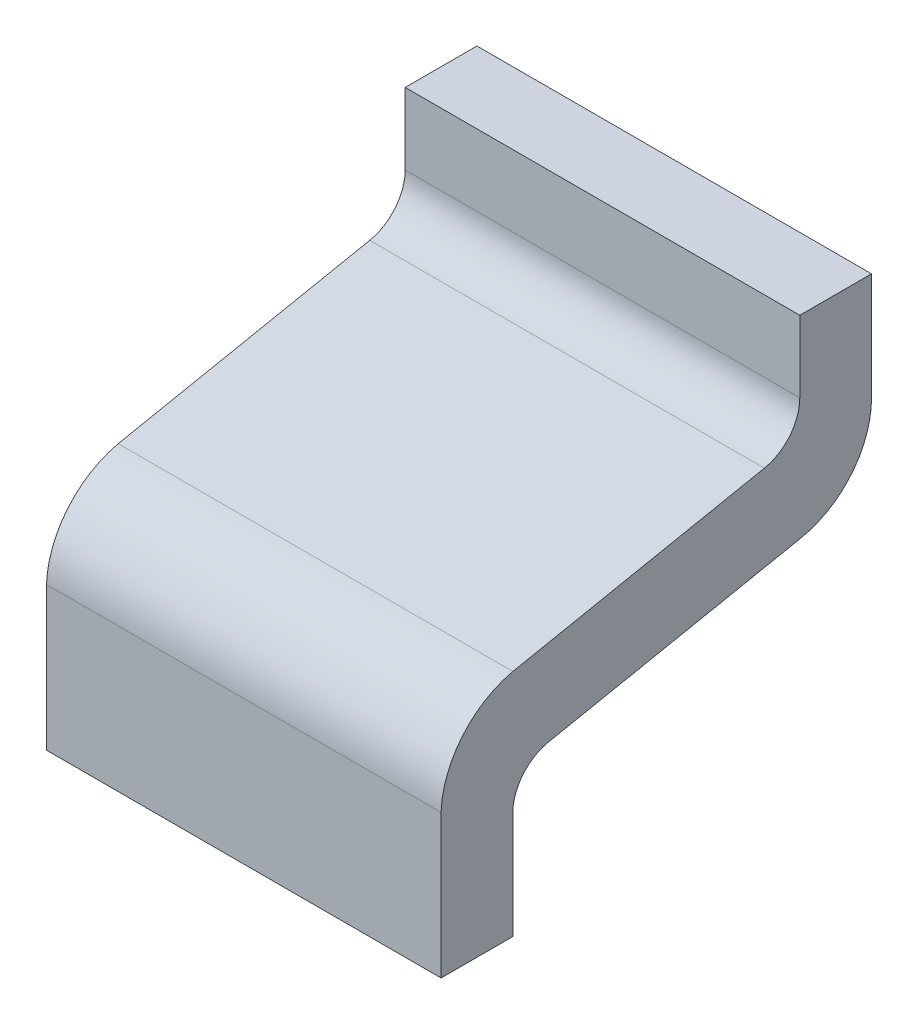
ISO-10303-21;
HEADER;
FILE_DESCRIPTION(('STEP AP214'),'2;1');
FILE_NAME('part.step','',(''),(''),'','','');
FILE_SCHEMA(('AUTOMOTIVE_DESIGN { 1 0 10303 214 1 1 1 1 }'));
ENDSEC;
DATA;
#1=APPLICATION_CONTEXT('core data for automotive mechanical design processes');
#2=APPLICATION_PROTOCOL_DEFINITION('international standard','automotive_design',2000,#1);
#3=PRODUCT_CONTEXT('',#1,'mechanical');
#4=PRODUCT('Part','Part','',(#3));
#5=PRODUCT_RELATED_PRODUCT_CATEGORY('part','',(#4));
#6=PRODUCT_DEFINITION_FORMATION('','',#4);
#7=PRODUCT_DEFINITION_CONTEXT('part definition',#1,'design');
#8=PRODUCT_DEFINITION('design','',#6,#7);
#9=PRODUCT_DEFINITION_SHAPE('','',#8);
#10=(LENGTH_UNIT() NAMED_UNIT(*) SI_UNIT(.MILLI.,.METRE.));
#11=(NAMED_UNIT(*) PLANE_ANGLE_UNIT() SI_UNIT($,.RADIAN.));
#12=(NAMED_UNIT(*) SI_UNIT($,.STERADIAN.) SOLID_ANGLE_UNIT());
#13=UNCERTAINTY_MEASURE_WITH_UNIT(LENGTH_MEASURE(1.E-05),#10,'distance_accuracy_value','');
#14=(GEOMETRIC_REPRESENTATION_CONTEXT(3) GLOBAL_UNCERTAINTY_ASSIGNED_CONTEXT((#13)) GLOBAL_UNIT_ASSIGNED_CONTEXT((#10,
#11,#12)) REPRESENTATION_CONTEXT('',''));
#15=CARTESIAN_POINT('',(0.,0.,0.));
#16=DIRECTION('',(0.,0.,1.));
#17=DIRECTION('',(1.,0.,0.));
#18=AXIS2_PLACEMENT_3D('',#15,#16,#17);
#19=CARTESIAN_POINT('',(-0.95,-0.95,0.));
#20=DIRECTION('',(0.,0.,1.));
#21=DIRECTION('',(1.,0.,0.));
#22=AXIS2_PLACEMENT_3D('',#19,#20,#21);
#23=PLANE('',#22);
#24=DIRECTION('',(-1.,0.,0.));
#25=VECTOR('',#24,1.);
#26=CARTESIAN_POINT('',(-1.15,-1.2,0.));
#27=LINE('',#26,#25);
#28=CARTESIAN_POINT('',(-1.15,-1.2,0.));
#29=VERTEX_POINT('',#28);
#30=CARTESIAN_POINT('',(-0.6,-1.2,0.));
#31=VERTEX_POINT('',#30);
#32=EDGE_CURVE('E202',#29,#31,#27,.F.);
#33=ORIENTED_EDGE('',*,*,#32,.T.);
#34=DIRECTION('',(0.,-1.,0.));
#35=VECTOR('',#34,1.);
#36=CARTESIAN_POINT('',(-0.6,-1.2,0.));
#37=LINE('',#36,#35);
#38=CARTESIAN_POINT('',(-0.6,-1.00000004750623,-3.62638521642089E-13));
#39=VERTEX_POINT('',#38);
#40=EDGE_CURVE('E117',#31,#39,#37,.F.);
#41=ORIENTED_EDGE('',*,*,#40,.T.);
#42=DIRECTION('',(1.,0.,0.));
#43=VECTOR('',#42,1.);
#44=CARTESIAN_POINT('',(-0.75,-1.00000004749703,-7.25277043284178E-13));
#45=LINE('',#44,#43);
#46=CARTESIAN_POINT('',(-1.15,-1.00000004750623,-3.62638521642089E-13));
#47=VERTEX_POINT('',#46);
#48=EDGE_CURVE('E111',#47,#39,#45,.T.);
#49=ORIENTED_EDGE('',*,*,#48,.F.);
#50=DIRECTION('',(0.,1.,0.));
#51=VECTOR('',#50,1.);
#52=CARTESIAN_POINT('',(-1.15,-0.7,0.));
#53=LINE('',#52,#51);
#54=EDGE_CURVE('E114',#47,#29,#53,.F.);
#55=ORIENTED_EDGE('',*,*,#54,.T.);
#56=EDGE_LOOP('',(#33,#41,#49,#55));
#57=FACE_BOUND('',#56,.T.);
#58=ADVANCED_FACE('F17',(#57),#23,.T.);
#59=CARTESIAN_POINT('',(-1.15,-1.2,0.));
#60=DIRECTION('',(0.,1.,0.));
#61=DIRECTION('',(-1.,0.,0.));
#62=AXIS2_PLACEMENT_3D('',#59,#60,#61);
#63=PLANE('',#62);
#64=DIRECTION('',(0.,0.,1.));
#65=VECTOR('',#64,1.);
#66=CARTESIAN_POINT('',(-0.6,-1.2,0.));
#67=LINE('',#66,#65);
#68=CARTESIAN_POINT('',(-0.6,-1.2,-0.1));
#69=VERTEX_POINT('',#68);
#70=EDGE_CURVE('E154',#69,#31,#67,.T.);
#71=ORIENTED_EDGE('',*,*,#70,.T.);
#72=ORIENTED_EDGE('',*,*,#32,.F.);
#73=DIRECTION('',(0.,0.,1.));
#74=VECTOR('',#73,1.);
#75=CARTESIAN_POINT('',(-1.15,-1.2,0.));
#76=LINE('',#75,#74);
#77=CARTESIAN_POINT('',(-1.15,-1.2,-0.1));
#78=VERTEX_POINT('',#77);
#79=EDGE_CURVE('E133',#29,#78,#76,.F.);
#80=ORIENTED_EDGE('',*,*,#79,.T.);
#81=DIRECTION('',(-1.,0.,0.));
#82=VECTOR('',#81,1.);
#83=CARTESIAN_POINT('',(-0.75,-1.2,-0.1));
#84=LINE('',#83,#82);
#85=EDGE_CURVE('E199',#69,#78,#84,.T.);
#86=ORIENTED_EDGE('',*,*,#85,.F.);
#87=EDGE_LOOP('',(#71,#72,#80,#86));
#88=FACE_BOUND('',#87,.T.);
#89=ADVANCED_FACE('F338',(#88),#63,.F.);
#90=CARTESIAN_POINT('',(-0.75,-1.05,-0.1));
#91=DIRECTION('',(0.,0.,-1.));
#92=DIRECTION('',(-1.,0.,0.));
#93=AXIS2_PLACEMENT_3D('',#90,#91,#92);
#94=PLANE('',#93);
#95=ORIENTED_EDGE('',*,*,#85,.T.);
#96=DIRECTION('',(0.,1.,0.));
#97=VECTOR('',#96,1.);
#98=CARTESIAN_POINT('',(-1.15,-0.7,-0.1));
#99=LINE('',#98,#97);
#100=CARTESIAN_POINT('',(-1.15,-1.05,-0.099999999999953));
#101=VERTEX_POINT('',#100);
#102=EDGE_CURVE('E136',#78,#101,#99,.T.);
#103=ORIENTED_EDGE('',*,*,#102,.T.);
#104=DIRECTION('',(1.,0.,0.));
#105=VECTOR('',#104,1.);
#106=CARTESIAN_POINT('',(-0.75,-1.05,-0.099999999999906));
#107=LINE('',#106,#105);
#108=CARTESIAN_POINT('',(-0.6,-1.05,-0.0999999999999295));
#109=VERTEX_POINT('',#108);
#110=EDGE_CURVE('E197',#101,#109,#107,.T.);
#111=ORIENTED_EDGE('',*,*,#110,.T.);
#112=DIRECTION('',(0.,-1.,0.));
#113=VECTOR('',#112,1.);
#114=CARTESIAN_POINT('',(-0.6,-1.2,-0.1));
#115=LINE('',#114,#113);
#116=EDGE_CURVE('E157',#109,#69,#115,.T.);
#117=ORIENTED_EDGE('',*,*,#116,.T.);
#118=EDGE_LOOP('',(#95,#103,#111,#117));
#119=FACE_BOUND('',#118,.T.);
#120=ADVANCED_FACE('F235',(#119),#94,.T.);
#121=CARTESIAN_POINT('',(-0.75,-1.050999994712,-0.162200018196));
#122=DIRECTION('',(1.,0.,0.));
#123=DIRECTION('',(0.,1.,0.));
#124=AXIS2_PLACEMENT_3D('',#121,#122,#123);
#125=CYLINDRICAL_SURFACE('',#124,0.06220805617457);
#126=CARTESIAN_POINT('',(-0.6,-1.050999994712,-0.162200018196));
#127=DIRECTION('',(1.,0.,0.));
#128=DIRECTION('',(0.,1.,0.));
#129=AXIS2_PLACEMENT_3D('',#126,#127,#128);
#130=CIRCLE('',#129,0.06220805617457);
#131=CARTESIAN_POINT('',(-0.6,-0.989999976430254,-0.150000017266841));
#132=VERTEX_POINT('',#131);
#133=EDGE_CURVE('E160',#132,#109,#130,.T.);
#134=ORIENTED_EDGE('',*,*,#133,.T.);
#135=ORIENTED_EDGE('',*,*,#110,.F.);
#136=CARTESIAN_POINT('',(-1.15,-1.050999994712,-0.162200018196));
#137=DIRECTION('',(1.,0.,0.));
#138=DIRECTION('',(0.,1.,0.));
#139=AXIS2_PLACEMENT_3D('',#136,#137,#138);
#140=CIRCLE('',#139,0.06220805617457);
#141=CARTESIAN_POINT('',(-1.15,-0.989999976430254,-0.150000017266841));
#142=VERTEX_POINT('',#141);
#143=EDGE_CURVE('E221',#101,#142,#140,.F.);
#144=ORIENTED_EDGE('',*,*,#143,.T.);
#145=DIRECTION('',(1.,0.,0.));
#146=VECTOR('',#145,1.);
#147=CARTESIAN_POINT('',(-0.75,-0.989999976430426,-0.150000017267085));
#148=LINE('',#147,#146);
#149=EDGE_CURVE('E194',#132,#142,#148,.F.);
#150=ORIENTED_EDGE('',*,*,#149,.F.);
#151=EDGE_LOOP('',(#134,#135,#144,#150));
#152=FACE_BOUND('',#151,.T.);
#153=ADVANCED_FACE('F228',(#152),#125,.F.);
#154=CARTESIAN_POINT('',(-0.75,-0.91999999553,-0.5));
#155=DIRECTION('',(0.,-0.980580684120765,-0.196116092988953));
#156=DIRECTION('',(0.,0.196116092988953,-0.980580684120765));
#157=AXIS2_PLACEMENT_3D('',#154,#155,#156);
#158=PLANE('',#157);
#159=ORIENTED_EDGE('',*,*,#149,.T.);
#160=DIRECTION('',(0.,0.19611609298776,-0.980580684121004));
#161=VECTOR('',#160,1.);
#162=CARTESIAN_POINT('',(-1.15,-0.98999997643,-0.150000017267));
#163=LINE('',#162,#161);
#164=CARTESIAN_POINT('',(-1.15,-0.919999995529999,-0.500000000000003));
#165=VERTEX_POINT('',#164);
#166=EDGE_CURVE('E220',#142,#165,#163,.T.);
#167=ORIENTED_EDGE('',*,*,#166,.T.);
#168=DIRECTION('',(1.,0.,0.));
#169=VECTOR('',#168,1.);
#170=CARTESIAN_POINT('',(-0.75,-0.91999999553,-0.5));
#171=LINE('',#170,#169);
#172=CARTESIAN_POINT('',(-0.6,-0.919999995529999,-0.500000000000002));
#173=VERTEX_POINT('',#172);
#174=EDGE_CURVE('E191',#173,#165,#171,.F.);
#175=ORIENTED_EDGE('',*,*,#174,.F.);
#176=DIRECTION('',(0.,-0.19611609298776,0.980580684121004));
#177=VECTOR('',#176,1.);
#178=CARTESIAN_POINT('',(-0.6,-0.91999999553,-0.5));
#179=LINE('',#178,#177);
#180=EDGE_CURVE('E163',#173,#132,#179,.T.);
#181=ORIENTED_EDGE('',*,*,#180,.T.);
#182=EDGE_LOOP('',(#159,#167,#175,#181));
#183=FACE_BOUND('',#182,.T.);
#184=ADVANCED_FACE('F265',(#183),#158,.T.);
#185=CARTESIAN_POINT('',(-0.75,-0.8,-0.478000005364));
#186=DIRECTION('',(1.,0.,0.));
#187=DIRECTION('',(0.,1.,0.));
#188=AXIS2_PLACEMENT_3D('',#185,#186,#187);
#189=CYLINDRICAL_SURFACE('',#188,0.121999994636);
#190=ORIENTED_EDGE('',*,*,#174,.T.);
#191=CARTESIAN_POINT('',(-1.15,-0.8,-0.478000005364));
#192=DIRECTION('',(1.,0.,0.));
#193=DIRECTION('',(0.,1.,0.));
#194=AXIS2_PLACEMENT_3D('',#191,#192,#193);
#195=CIRCLE('',#194,0.121999994636);
#196=CARTESIAN_POINT('',(-1.15,-0.8,-0.6));
#197=VERTEX_POINT('',#196);
#198=EDGE_CURVE('E218',#165,#197,#195,.T.);
#199=ORIENTED_EDGE('',*,*,#198,.T.);
#200=DIRECTION('',(1.,0.,0.));
#201=VECTOR('',#200,1.);
#202=CARTESIAN_POINT('',(-0.95,-0.8,-0.6));
#203=LINE('',#202,#201);
#204=CARTESIAN_POINT('',(-0.6,-0.8,-0.6));
#205=VERTEX_POINT('',#204);
#206=EDGE_CURVE('E81',#197,#205,#203,.T.);
#207=ORIENTED_EDGE('',*,*,#206,.T.);
#208=CARTESIAN_POINT('',(-0.6,-0.8,-0.478000005364));
#209=DIRECTION('',(1.,0.,0.));
#210=DIRECTION('',(0.,1.,0.));
#211=AXIS2_PLACEMENT_3D('',#208,#209,#210);
#212=CIRCLE('',#211,0.121999994636);
#213=EDGE_CURVE('E20',#205,#173,#212,.F.);
#214=ORIENTED_EDGE('',*,*,#213,.T.);
#215=EDGE_LOOP('',(#190,#199,#207,#214));
#216=FACE_BOUND('',#215,.T.);
#217=ADVANCED_FACE('F263',(#216),#189,.T.);
#218=CARTESIAN_POINT('',(-0.95,-0.95,-0.6));
#219=DIRECTION('',(0.,0.,1.));
#220=DIRECTION('',(1.,0.,0.));
#221=AXIS2_PLACEMENT_3D('',#218,#219,#220);
#222=PLANE('',#221);
#223=DIRECTION('',(0.,1.,0.));
#224=VECTOR('',#223,1.);
#225=CARTESIAN_POINT('',(-1.15,-0.7,-0.6));
#226=LINE('',#225,#224);
#227=CARTESIAN_POINT('',(-1.15,-0.65,-0.6));
#228=VERTEX_POINT('',#227);
#229=EDGE_CURVE('E184',#197,#228,#226,.T.);
#230=ORIENTED_EDGE('',*,*,#229,.T.);
#231=DIRECTION('',(1.,0.,0.));
#232=VECTOR('',#231,1.);
#233=CARTESIAN_POINT('',(-0.75,-0.65,-0.6));
#234=LINE('',#233,#232);
#235=CARTESIAN_POINT('',(-0.6,-0.65,-0.6));
#236=VERTEX_POINT('',#235);
#237=EDGE_CURVE('E90',#228,#236,#234,.T.);
#238=ORIENTED_EDGE('',*,*,#237,.T.);
#239=DIRECTION('',(0.,-1.,0.));
#240=VECTOR('',#239,1.);
#241=CARTESIAN_POINT('',(-0.6,-1.2,-0.6));
#242=LINE('',#241,#240);
#243=EDGE_CURVE('E166',#236,#205,#242,.T.);
#244=ORIENTED_EDGE('',*,*,#243,.T.);
#245=ORIENTED_EDGE('',*,*,#206,.F.);
#246=EDGE_LOOP('',(#230,#238,#244,#245));
#247=FACE_BOUND('',#246,.T.);
#248=ADVANCED_FACE('F262',(#247),#222,.F.);
#249=CARTESIAN_POINT('',(-0.75,-0.65,0.));
#250=DIRECTION('',(0.,-1.,0.));
#251=DIRECTION('',(0.,0.,-1.));
#252=AXIS2_PLACEMENT_3D('',#249,#250,#251);
#253=PLANE('',#252);
#254=DIRECTION('',(0.,0.,1.));
#255=VECTOR('',#254,1.);
#256=CARTESIAN_POINT('',(-0.6,-0.65,0.));
#257=LINE('',#256,#255);
#258=CARTESIAN_POINT('',(-0.6,-0.65,-0.5));
#259=VERTEX_POINT('',#258);
#260=EDGE_CURVE('E168',#259,#236,#257,.F.);
#261=ORIENTED_EDGE('',*,*,#260,.T.);
#262=ORIENTED_EDGE('',*,*,#237,.F.);
#263=DIRECTION('',(0.,0.,1.));
#264=VECTOR('',#263,1.);
#265=CARTESIAN_POINT('',(-1.15,-0.65,0.));
#266=LINE('',#265,#264);
#267=CARTESIAN_POINT('',(-1.15,-0.65,-0.5));
#268=VERTEX_POINT('',#267);
#269=EDGE_CURVE('E180',#228,#268,#266,.T.);
#270=ORIENTED_EDGE('',*,*,#269,.T.);
#271=DIRECTION('',(1.,0.,0.));
#272=VECTOR('',#271,1.);
#273=CARTESIAN_POINT('',(-0.75,-0.65,-0.5));
#274=LINE('',#273,#272);
#275=EDGE_CURVE('E121',#259,#268,#274,.F.);
#276=ORIENTED_EDGE('',*,*,#275,.F.);
#277=EDGE_LOOP('',(#261,#262,#270,#276));
#278=FACE_BOUND('',#277,.T.);
#279=ADVANCED_FACE('F258',(#278),#253,.F.);
#280=CARTESIAN_POINT('',(-0.75,-0.749679468147,-0.5));
#281=DIRECTION('',(0.,0.,1.));
#282=DIRECTION('',(1.,0.,0.));
#283=AXIS2_PLACEMENT_3D('',#280,#281,#282);
#284=PLANE('',#283);
#285=ORIENTED_EDGE('',*,*,#275,.T.);
#286=DIRECTION('',(0.,1.,0.));
#287=VECTOR('',#286,1.);
#288=CARTESIAN_POINT('',(-1.15,-0.7,-0.5));
#289=LINE('',#288,#287);
#290=CARTESIAN_POINT('',(-1.15,-0.749679468147,-0.50000000000019));
#291=VERTEX_POINT('',#290);
#292=EDGE_CURVE('E183',#268,#291,#289,.F.);
#293=ORIENTED_EDGE('',*,*,#292,.T.);
#294=DIRECTION('',(1.,0.,0.));
#295=VECTOR('',#294,1.);
#296=CARTESIAN_POINT('',(-0.75,-0.749679468147,-0.50000000000038));
#297=LINE('',#296,#295);
#298=CARTESIAN_POINT('',(-0.6,-0.749679468147,-0.50000000000019));
#299=VERTEX_POINT('',#298);
#300=EDGE_CURVE('E138',#291,#299,#297,.T.);
#301=ORIENTED_EDGE('',*,*,#300,.T.);
#302=DIRECTION('',(0.,-1.,0.));
#303=VECTOR('',#302,1.);
#304=CARTESIAN_POINT('',(-0.6,-1.2,-0.5));
#305=LINE('',#304,#303);
#306=EDGE_CURVE('E120',#299,#259,#305,.F.);
#307=ORIENTED_EDGE('',*,*,#306,.T.);
#308=EDGE_LOOP('',(#285,#293,#301,#307));
#309=FACE_BOUND('',#308,.T.);
#310=ADVANCED_FACE('F246',(#309),#284,.T.);
#311=CARTESIAN_POINT('',(-0.75,-1.005049716317,-0.128059609711));
#312=DIRECTION('',(1.,0.,0.));
#313=DIRECTION('',(0.,1.,0.));
#314=AXIS2_PLACEMENT_3D('',#311,#312,#313);
#315=CYLINDRICAL_SURFACE('',#314,0.128159130749);
#316=DIRECTION('',(1.,0.,0.));
#317=VECTOR('',#316,1.);
#318=CARTESIAN_POINT('',(-0.75,-0.880000041798,-0.1));
#319=LINE('',#318,#317);
#320=CARTESIAN_POINT('',(-1.15,-0.880000041796324,-0.100000000008381));
#321=VERTEX_POINT('',#320);
#322=CARTESIAN_POINT('',(-0.6,-0.880000041796324,-0.100000000008381));
#323=VERTEX_POINT('',#322);
#324=EDGE_CURVE('E127',#321,#323,#319,.T.);
#325=ORIENTED_EDGE('',*,*,#324,.F.);
#326=CARTESIAN_POINT('',(-1.15,-1.005049716317,-0.128059609711));
#327=DIRECTION('',(1.,0.,0.));
#328=DIRECTION('',(0.,1.,0.));
#329=AXIS2_PLACEMENT_3D('',#326,#327,#328);
#330=CIRCLE('',#329,0.128159130749);
#331=EDGE_CURVE('E124',#321,#47,#330,.T.);
#332=ORIENTED_EDGE('',*,*,#331,.T.);
#333=ORIENTED_EDGE('',*,*,#48,.T.);
#334=CARTESIAN_POINT('',(-0.6,-1.005049716317,-0.128059609711));
#335=DIRECTION('',(1.,0.,0.));
#336=DIRECTION('',(0.,1.,0.));
#337=AXIS2_PLACEMENT_3D('',#334,#335,#336);
#338=CIRCLE('',#337,0.128159130749);
#339=EDGE_CURVE('E153',#39,#323,#338,.F.);
#340=ORIENTED_EDGE('',*,*,#339,.T.);
#341=EDGE_LOOP('',(#325,#332,#333,#340));
#342=FACE_BOUND('',#341,.T.);
#343=ADVANCED_FACE('F125',(#342),#315,.T.);
#344=CARTESIAN_POINT('',(-0.6,-1.2,0.));
#345=DIRECTION('',(-1.,0.,0.));
#346=DIRECTION('',(0.,-1.,0.));
#347=AXIS2_PLACEMENT_3D('',#344,#345,#346);
#348=PLANE('',#347);
#349=ORIENTED_EDGE('',*,*,#40,.F.);
#350=ORIENTED_EDGE('',*,*,#70,.F.);
#351=ORIENTED_EDGE('',*,*,#116,.F.);
#352=ORIENTED_EDGE('',*,*,#133,.F.);
#353=ORIENTED_EDGE('',*,*,#180,.F.);
#354=ORIENTED_EDGE('',*,*,#213,.F.);
#355=ORIENTED_EDGE('',*,*,#243,.F.);
#356=ORIENTED_EDGE('',*,*,#260,.F.);
#357=ORIENTED_EDGE('',*,*,#306,.F.);
#358=CARTESIAN_POINT('',(-0.6,-0.749679468147,-0.438618714989));
#359=DIRECTION('',(1.,0.,0.));
#360=DIRECTION('',(0.,1.,0.));
#361=AXIS2_PLACEMENT_3D('',#358,#359,#360);
#362=CIRCLE('',#361,0.06138128501138);
#363=CARTESIAN_POINT('',(-0.6,-0.80988793724747,-0.450560339595094));
#364=VERTEX_POINT('',#363);
#365=EDGE_CURVE('E134',#299,#364,#362,.F.);
#366=ORIENTED_EDGE('',*,*,#365,.T.);
#367=DIRECTION('',(0.,-0.196116233662029,0.980580655986146));
#368=VECTOR('',#367,1.);
#369=CARTESIAN_POINT('',(-0.6,-0.880000041798,-0.1));
#370=LINE('',#369,#368);
#371=EDGE_CURVE('E147',#323,#364,#370,.F.);
#372=ORIENTED_EDGE('',*,*,#371,.F.);
#373=ORIENTED_EDGE('',*,*,#339,.F.);
#374=EDGE_LOOP('',(#349,#350,#351,#352,#353,#354,#355,#356,#357,#366,#372,#373));
#375=FACE_BOUND('',#374,.T.);
#376=ADVANCED_FACE('F233',(#375),#348,.F.);
#377=CARTESIAN_POINT('',(-0.75,-0.749679468147,-0.438618714989));
#378=DIRECTION('',(1.,0.,0.));
#379=DIRECTION('',(0.,1.,0.));
#380=AXIS2_PLACEMENT_3D('',#377,#378,#379);
#381=CYLINDRICAL_SURFACE('',#380,0.06138128501138);
#382=ORIENTED_EDGE('',*,*,#365,.F.);
#383=ORIENTED_EDGE('',*,*,#300,.F.);
#384=CARTESIAN_POINT('',(-1.15,-0.749679468147,-0.438618714989));
#385=DIRECTION('',(1.,0.,0.));
#386=DIRECTION('',(0.,1.,0.));
#387=AXIS2_PLACEMENT_3D('',#384,#385,#386);
#388=CIRCLE('',#387,0.06138128501138);
#389=CARTESIAN_POINT('',(-1.15,-0.80988793724747,-0.450560339595094));
#390=VERTEX_POINT('',#389);
#391=EDGE_CURVE('E35',#291,#390,#388,.F.);
#392=ORIENTED_EDGE('',*,*,#391,.T.);
#393=DIRECTION('',(1.,0.,0.));
#394=VECTOR('',#393,1.);
#395=CARTESIAN_POINT('',(-0.75,-0.809887937247525,-0.450560339595105));
#396=LINE('',#395,#394);
#397=EDGE_CURVE('E26',#364,#390,#396,.F.);
#398=ORIENTED_EDGE('',*,*,#397,.F.);
#399=EDGE_LOOP('',(#382,#383,#392,#398));
#400=FACE_BOUND('',#399,.T.);
#401=ADVANCED_FACE('F250',(#400),#381,.F.);
#402=CARTESIAN_POINT('',(-1.15,-0.7,0.));
#403=DIRECTION('',(1.,0.,0.));
#404=DIRECTION('',(0.,1.,0.));
#405=AXIS2_PLACEMENT_3D('',#402,#403,#404);
#406=PLANE('',#405);
#407=DIRECTION('',(0.,-0.196116233662029,0.980580655986146));
#408=VECTOR('',#407,1.);
#409=CARTESIAN_POINT('',(-1.15,-0.880000041798,-0.1));
#410=LINE('',#409,#408);
#411=EDGE_CURVE('E11',#390,#321,#410,.T.);
#412=ORIENTED_EDGE('',*,*,#411,.F.);
#413=ORIENTED_EDGE('',*,*,#391,.F.);
#414=ORIENTED_EDGE('',*,*,#292,.F.);
#415=ORIENTED_EDGE('',*,*,#269,.F.);
#416=ORIENTED_EDGE('',*,*,#229,.F.);
#417=ORIENTED_EDGE('',*,*,#198,.F.);
#418=ORIENTED_EDGE('',*,*,#166,.F.);
#419=ORIENTED_EDGE('',*,*,#143,.F.);
#420=ORIENTED_EDGE('',*,*,#102,.F.);
#421=ORIENTED_EDGE('',*,*,#79,.F.);
#422=ORIENTED_EDGE('',*,*,#54,.F.);
#423=ORIENTED_EDGE('',*,*,#331,.F.);
#424=EDGE_LOOP('',(#412,#413,#414,#415,#416,#417,#418,#419,#420,#421,#422,#423));
#425=FACE_BOUND('',#424,.T.);
#426=ADVANCED_FACE('F131',(#425),#406,.F.);
#427=CARTESIAN_POINT('',(-0.75,-0.880000041798,-0.1));
#428=DIRECTION('',(0.,0.980580655986146,0.196116233662029));
#429=DIRECTION('',(0.,-0.196116233662029,0.980580655986146));
#430=AXIS2_PLACEMENT_3D('',#427,#428,#429);
#431=PLANE('',#430);
#432=ORIENTED_EDGE('',*,*,#397,.T.);
#433=ORIENTED_EDGE('',*,*,#411,.T.);
#434=ORIENTED_EDGE('',*,*,#324,.T.);
#435=ORIENTED_EDGE('',*,*,#371,.T.);
#436=EDGE_LOOP('',(#432,#433,#434,#435));
#437=FACE_BOUND('',#436,.T.);
#438=ADVANCED_FACE('F252',(#437),#431,.T.);
#439=CLOSED_SHELL('',(#58,#89,#120,#153,#184,#217,#248,#279,#310,#343,#376,#401,#426,#438));
#440=MANIFOLD_SOLID_BREP('B1',#439);
#441=ADVANCED_BREP_SHAPE_REPRESENTATION('',(#18,#440),#14);
#442=SHAPE_DEFINITION_REPRESENTATION(#9,#441);
ENDSEC;
END-ISO-10303-21;
